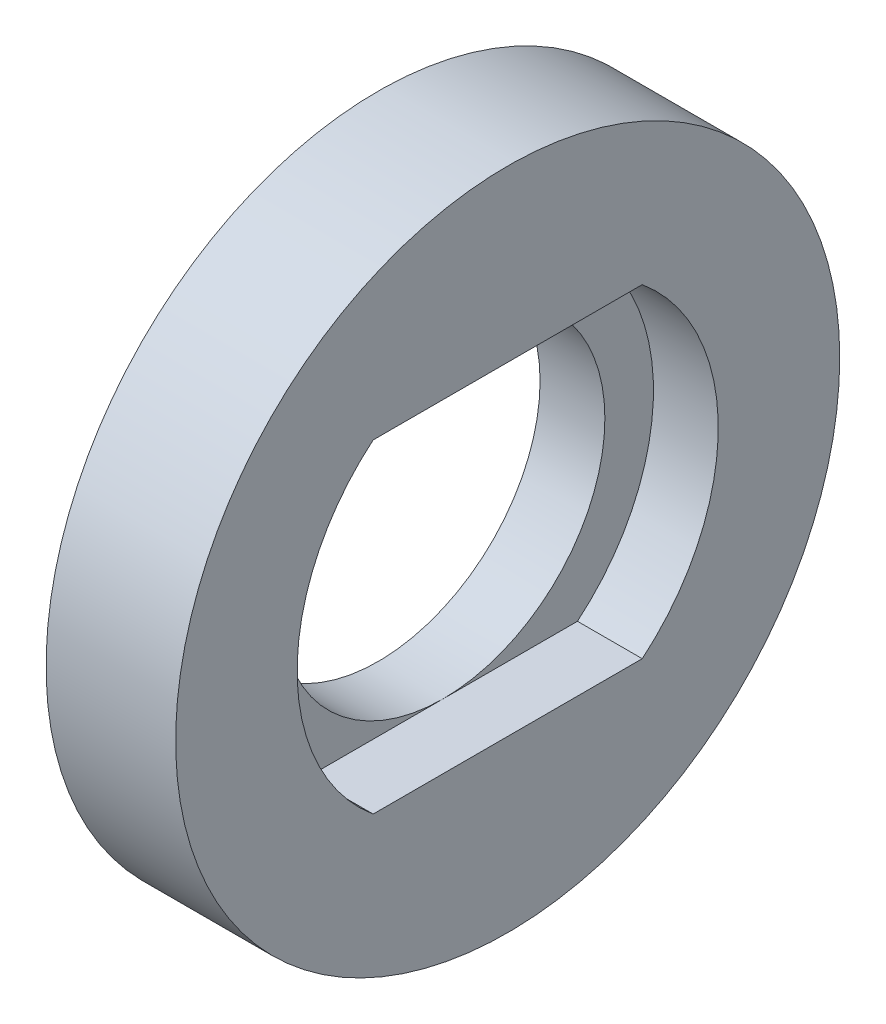
ISO-10303-21;
HEADER;
FILE_DESCRIPTION(('STEP AP214'),'2;1');
FILE_NAME('part.step','',(''),(''),'','','');
FILE_SCHEMA(('AUTOMOTIVE_DESIGN { 1 0 10303 214 1 1 1 1 }'));
ENDSEC;
DATA;
#1=APPLICATION_CONTEXT('core data for automotive mechanical design processes');
#2=APPLICATION_PROTOCOL_DEFINITION('international standard','automotive_design',2000,#1);
#3=PRODUCT_CONTEXT('',#1,'mechanical');
#4=PRODUCT('Part','Part','',(#3));
#5=PRODUCT_RELATED_PRODUCT_CATEGORY('part','',(#4));
#6=PRODUCT_DEFINITION_FORMATION('','',#4);
#7=PRODUCT_DEFINITION_CONTEXT('part definition',#1,'design');
#8=PRODUCT_DEFINITION('design','',#6,#7);
#9=PRODUCT_DEFINITION_SHAPE('','',#8);
#10=(LENGTH_UNIT() NAMED_UNIT(*) SI_UNIT(.MILLI.,.METRE.));
#11=(NAMED_UNIT(*) PLANE_ANGLE_UNIT() SI_UNIT($,.RADIAN.));
#12=(NAMED_UNIT(*) SI_UNIT($,.STERADIAN.) SOLID_ANGLE_UNIT());
#13=UNCERTAINTY_MEASURE_WITH_UNIT(LENGTH_MEASURE(1.E-05),#10,'distance_accuracy_value','');
#14=(GEOMETRIC_REPRESENTATION_CONTEXT(3) GLOBAL_UNCERTAINTY_ASSIGNED_CONTEXT((#13)) GLOBAL_UNIT_ASSIGNED_CONTEXT((#10,
#11,#12)) REPRESENTATION_CONTEXT('',''));
#15=CARTESIAN_POINT('',(0.,0.,0.));
#16=DIRECTION('',(0.,0.,1.));
#17=DIRECTION('',(1.,0.,0.));
#18=AXIS2_PLACEMENT_3D('',#15,#16,#17);
#19=CARTESIAN_POINT('',(2.,0.,0.));
#20=DIRECTION('',(1.,0.,0.));
#21=DIRECTION('',(0.,0.,-1.));
#22=AXIS2_PLACEMENT_3D('',#19,#20,#21);
#23=PLANE('',#22);
#24=CARTESIAN_POINT('',(2.,0.,0.));
#25=DIRECTION('',(1.,0.,0.));
#26=DIRECTION('',(0.,0.,-1.));
#27=AXIS2_PLACEMENT_3D('',#24,#25,#26);
#28=CIRCLE('',#27,5.);
#29=CARTESIAN_POINT('',(2.,5.,0.));
#30=VERTEX_POINT('',#29);
#31=CARTESIAN_POINT('',(2.,-5.,0.));
#32=VERTEX_POINT('',#31);
#33=EDGE_CURVE('E48',#30,#32,#28,.T.);
#34=ORIENTED_EDGE('',*,*,#33,.F.);
#35=DIRECTION('',(0.,0.,-1.));
#36=VECTOR('',#35,1.);
#37=CARTESIAN_POINT('',(2.,5.,0.));
#38=LINE('',#37,#36);
#39=CARTESIAN_POINT('',(2.,5.,4.15331193145904));
#40=VERTEX_POINT('',#39);
#41=EDGE_CURVE('E89',#40,#30,#38,.T.);
#42=ORIENTED_EDGE('',*,*,#41,.F.);
#43=CARTESIAN_POINT('',(2.,0.,0.));
#44=DIRECTION('',(1.,0.,0.));
#45=DIRECTION('',(0.,0.,-1.));
#46=AXIS2_PLACEMENT_3D('',#43,#44,#45);
#47=CIRCLE('',#46,6.5);
#48=CARTESIAN_POINT('',(2.,-5.,4.15331193145904));
#49=VERTEX_POINT('',#48);
#50=EDGE_CURVE('E121',#40,#49,#47,.T.);
#51=ORIENTED_EDGE('',*,*,#50,.T.);
#52=DIRECTION('',(0.,0.,-1.));
#53=VECTOR('',#52,1.);
#54=CARTESIAN_POINT('',(2.,-5.,0.));
#55=LINE('',#54,#53);
#56=EDGE_CURVE('E92',#49,#32,#55,.T.);
#57=ORIENTED_EDGE('',*,*,#56,.T.);
#58=EDGE_LOOP('',(#34,#42,#51,#57));
#59=FACE_BOUND('',#58,.T.);
#60=ADVANCED_FACE('F34',(#59),#23,.T.);
#61=CARTESIAN_POINT('',(4.,0.,0.));
#62=DIRECTION('',(-1.,0.,0.));
#63=DIRECTION('',(0.,0.,1.));
#64=AXIS2_PLACEMENT_3D('',#61,#62,#63);
#65=CYLINDRICAL_SURFACE('',#64,10.25);
#66=CARTESIAN_POINT('',(4.,0.,0.));
#67=DIRECTION('',(1.,0.,0.));
#68=DIRECTION('',(0.,0.,-1.));
#69=AXIS2_PLACEMENT_3D('',#66,#67,#68);
#70=CIRCLE('',#69,10.25);
#71=CARTESIAN_POINT('',(4.,0.,-10.25));
#72=VERTEX_POINT('',#71);
#73=EDGE_CURVE('E11',#72,#72,#70,.T.);
#74=ORIENTED_EDGE('',*,*,#73,.F.);
#75=EDGE_LOOP('',(#74));
#76=FACE_BOUND('',#75,.T.);
#77=CARTESIAN_POINT('',(0.,0.,0.));
#78=DIRECTION('',(1.,0.,0.));
#79=DIRECTION('',(0.,0.,-1.));
#80=AXIS2_PLACEMENT_3D('',#77,#78,#79);
#81=CIRCLE('',#80,10.25);
#82=CARTESIAN_POINT('',(0.,0.,-10.25));
#83=VERTEX_POINT('',#82);
#84=EDGE_CURVE('E38',#83,#83,#81,.T.);
#85=ORIENTED_EDGE('',*,*,#84,.T.);
#86=EDGE_LOOP('',(#85));
#87=FACE_BOUND('',#86,.T.);
#88=ADVANCED_FACE('F36',(#76,#87),#65,.T.);
#89=CARTESIAN_POINT('',(4.,0.,0.));
#90=DIRECTION('',(1.,0.,0.));
#91=DIRECTION('',(0.,0.,-1.));
#92=AXIS2_PLACEMENT_3D('',#89,#90,#91);
#93=PLANE('',#92);
#94=CARTESIAN_POINT('',(4.,0.,0.));
#95=DIRECTION('',(1.,0.,0.));
#96=DIRECTION('',(0.,0.,-1.));
#97=AXIS2_PLACEMENT_3D('',#94,#95,#96);
#98=CIRCLE('',#97,6.5);
#99=CARTESIAN_POINT('',(4.,5.,4.15331193145904));
#100=VERTEX_POINT('',#99);
#101=CARTESIAN_POINT('',(4.,-5.,4.15331193145904));
#102=VERTEX_POINT('',#101);
#103=EDGE_CURVE('E56',#100,#102,#98,.T.);
#104=ORIENTED_EDGE('',*,*,#103,.F.);
#105=DIRECTION('',(0.,0.,-1.));
#106=VECTOR('',#105,1.);
#107=CARTESIAN_POINT('',(4.,5.,0.));
#108=LINE('',#107,#106);
#109=CARTESIAN_POINT('',(4.,5.,-4.15331193145904));
#110=VERTEX_POINT('',#109);
#111=EDGE_CURVE('E118',#100,#110,#108,.T.);
#112=ORIENTED_EDGE('',*,*,#111,.T.);
#113=CARTESIAN_POINT('',(4.,0.,0.));
#114=DIRECTION('',(1.,0.,0.));
#115=DIRECTION('',(0.,0.,-1.));
#116=AXIS2_PLACEMENT_3D('',#113,#114,#115);
#117=CIRCLE('',#116,6.5);
#118=CARTESIAN_POINT('',(4.,-5.,-4.15331193145904));
#119=VERTEX_POINT('',#118);
#120=EDGE_CURVE('E115',#119,#110,#117,.T.);
#121=ORIENTED_EDGE('',*,*,#120,.F.);
#122=DIRECTION('',(0.,0.,-1.));
#123=VECTOR('',#122,1.);
#124=CARTESIAN_POINT('',(4.,-5.,0.));
#125=LINE('',#124,#123);
#126=EDGE_CURVE('E112',#102,#119,#125,.T.);
#127=ORIENTED_EDGE('',*,*,#126,.F.);
#128=EDGE_LOOP('',(#104,#112,#121,#127));
#129=FACE_BOUND('',#128,.T.);
#130=ORIENTED_EDGE('',*,*,#73,.T.);
#131=EDGE_LOOP('',(#130));
#132=FACE_BOUND('',#131,.T.);
#133=ADVANCED_FACE('F133',(#129,#132),#93,.T.);
#134=CARTESIAN_POINT('',(0.,0.,0.));
#135=DIRECTION('',(1.,0.,0.));
#136=DIRECTION('',(0.,0.,-1.));
#137=AXIS2_PLACEMENT_3D('',#134,#135,#136);
#138=PLANE('',#137);
#139=CARTESIAN_POINT('',(0.,0.,0.));
#140=DIRECTION('',(1.,0.,0.));
#141=DIRECTION('',(0.,0.,-1.));
#142=AXIS2_PLACEMENT_3D('',#139,#140,#141);
#143=CIRCLE('',#142,5.);
#144=CARTESIAN_POINT('',(0.,0.,-5.));
#145=VERTEX_POINT('',#144);
#146=EDGE_CURVE('E93',#145,#145,#143,.T.);
#147=ORIENTED_EDGE('',*,*,#146,.T.);
#148=EDGE_LOOP('',(#147));
#149=FACE_BOUND('',#148,.T.);
#150=ORIENTED_EDGE('',*,*,#84,.F.);
#151=EDGE_LOOP('',(#150));
#152=FACE_BOUND('',#151,.T.);
#153=ADVANCED_FACE('F136',(#149,#152),#138,.F.);
#154=CARTESIAN_POINT('',(2.,0.,0.));
#155=DIRECTION('',(1.,0.,0.));
#156=DIRECTION('',(0.,0.,-1.));
#157=AXIS2_PLACEMENT_3D('',#154,#155,#156);
#158=CYLINDRICAL_SURFACE('',#157,6.5);
#159=ORIENTED_EDGE('',*,*,#103,.T.);
#160=DIRECTION('',(1.,0.,0.));
#161=VECTOR('',#160,1.);
#162=CARTESIAN_POINT('',(2.,-5.,4.15331193145904));
#163=LINE('',#162,#161);
#164=EDGE_CURVE('E105',#49,#102,#163,.T.);
#165=ORIENTED_EDGE('',*,*,#164,.F.);
#166=ORIENTED_EDGE('',*,*,#50,.F.);
#167=DIRECTION('',(1.,0.,0.));
#168=VECTOR('',#167,1.);
#169=CARTESIAN_POINT('',(2.,5.,4.15331193145904));
#170=LINE('',#169,#168);
#171=EDGE_CURVE('E104',#40,#100,#170,.T.);
#172=ORIENTED_EDGE('',*,*,#171,.T.);
#173=EDGE_LOOP('',(#159,#165,#166,#172));
#174=FACE_BOUND('',#173,.T.);
#175=ADVANCED_FACE('F146',(#174),#158,.F.);
#176=CARTESIAN_POINT('',(2.,5.,0.));
#177=DIRECTION('',(0.,-1.,0.));
#178=DIRECTION('',(0.,0.,-1.));
#179=AXIS2_PLACEMENT_3D('',#176,#177,#178);
#180=PLANE('',#179);
#181=ORIENTED_EDGE('',*,*,#111,.F.);
#182=ORIENTED_EDGE('',*,*,#171,.F.);
#183=ORIENTED_EDGE('',*,*,#41,.T.);
#184=CARTESIAN_POINT('',(2.,5.,-4.15331193145904));
#185=VERTEX_POINT('',#184);
#186=EDGE_CURVE('E95',#30,#185,#38,.T.);
#187=ORIENTED_EDGE('',*,*,#186,.T.);
#188=DIRECTION('',(1.,0.,0.));
#189=VECTOR('',#188,1.);
#190=CARTESIAN_POINT('',(2.,5.,-4.15331193145904));
#191=LINE('',#190,#189);
#192=EDGE_CURVE('E123',#185,#110,#191,.T.);
#193=ORIENTED_EDGE('',*,*,#192,.T.);
#194=EDGE_LOOP('',(#181,#182,#183,#187,#193));
#195=FACE_BOUND('',#194,.T.);
#196=ADVANCED_FACE('F103',(#195),#180,.T.);
#197=CARTESIAN_POINT('',(2.,0.,0.));
#198=DIRECTION('',(1.,0.,0.));
#199=DIRECTION('',(0.,0.,-1.));
#200=AXIS2_PLACEMENT_3D('',#197,#198,#199);
#201=CYLINDRICAL_SURFACE('',#200,6.5);
#202=ORIENTED_EDGE('',*,*,#120,.T.);
#203=ORIENTED_EDGE('',*,*,#192,.F.);
#204=CARTESIAN_POINT('',(2.,0.,0.));
#205=DIRECTION('',(1.,0.,0.));
#206=DIRECTION('',(0.,0.,-1.));
#207=AXIS2_PLACEMENT_3D('',#204,#205,#206);
#208=CIRCLE('',#207,6.5);
#209=CARTESIAN_POINT('',(2.,-5.,-4.15331193145904));
#210=VERTEX_POINT('',#209);
#211=EDGE_CURVE('E98',#210,#185,#208,.T.);
#212=ORIENTED_EDGE('',*,*,#211,.F.);
#213=DIRECTION('',(1.,0.,0.));
#214=VECTOR('',#213,1.);
#215=CARTESIAN_POINT('',(2.,-5.,-4.15331193145904));
#216=LINE('',#215,#214);
#217=EDGE_CURVE('E106',#210,#119,#216,.T.);
#218=ORIENTED_EDGE('',*,*,#217,.T.);
#219=EDGE_LOOP('',(#202,#203,#212,#218));
#220=FACE_BOUND('',#219,.T.);
#221=ADVANCED_FACE('F127',(#220),#201,.F.);
#222=CARTESIAN_POINT('',(2.,-5.,0.));
#223=DIRECTION('',(0.,-1.,0.));
#224=DIRECTION('',(0.,0.,-1.));
#225=AXIS2_PLACEMENT_3D('',#222,#223,#224);
#226=PLANE('',#225);
#227=ORIENTED_EDGE('',*,*,#126,.T.);
#228=ORIENTED_EDGE('',*,*,#217,.F.);
#229=EDGE_CURVE('E238',#32,#210,#55,.T.);
#230=ORIENTED_EDGE('',*,*,#229,.F.);
#231=ORIENTED_EDGE('',*,*,#56,.F.);
#232=ORIENTED_EDGE('',*,*,#164,.T.);
#233=EDGE_LOOP('',(#227,#228,#230,#231,#232));
#234=FACE_BOUND('',#233,.T.);
#235=ADVANCED_FACE('F131',(#234),#226,.F.);
#236=EDGE_CURVE('E78',#32,#30,#28,.T.);
#237=ORIENTED_EDGE('',*,*,#236,.F.);
#238=ORIENTED_EDGE('',*,*,#229,.T.);
#239=ORIENTED_EDGE('',*,*,#211,.T.);
#240=ORIENTED_EDGE('',*,*,#186,.F.);
#241=EDGE_LOOP('',(#237,#238,#239,#240));
#242=FACE_BOUND('',#241,.T.);
#243=ADVANCED_FACE('F96',(#242),#23,.T.);
#244=CARTESIAN_POINT('',(0.,0.,0.));
#245=DIRECTION('',(1.,0.,0.));
#246=DIRECTION('',(0.,0.,-1.));
#247=AXIS2_PLACEMENT_3D('',#244,#245,#246);
#248=CYLINDRICAL_SURFACE('',#247,5.);
#249=ORIENTED_EDGE('',*,*,#146,.F.);
#250=EDGE_LOOP('',(#249));
#251=FACE_BOUND('',#250,.T.);
#252=ORIENTED_EDGE('',*,*,#33,.T.);
#253=ORIENTED_EDGE('',*,*,#236,.T.);
#254=EDGE_LOOP('',(#252,#253));
#255=FACE_BOUND('',#254,.T.);
#256=ADVANCED_FACE('F79',(#251,#255),#248,.F.);
#257=CLOSED_SHELL('',(#60,#88,#133,#153,#175,#196,#221,#235,#243,#256));
#258=MANIFOLD_SOLID_BREP('B2',#257);
#259=ADVANCED_BREP_SHAPE_REPRESENTATION('',(#18,#258),#14);
#260=SHAPE_DEFINITION_REPRESENTATION(#9,#259);
ENDSEC;
END-ISO-10303-21;
